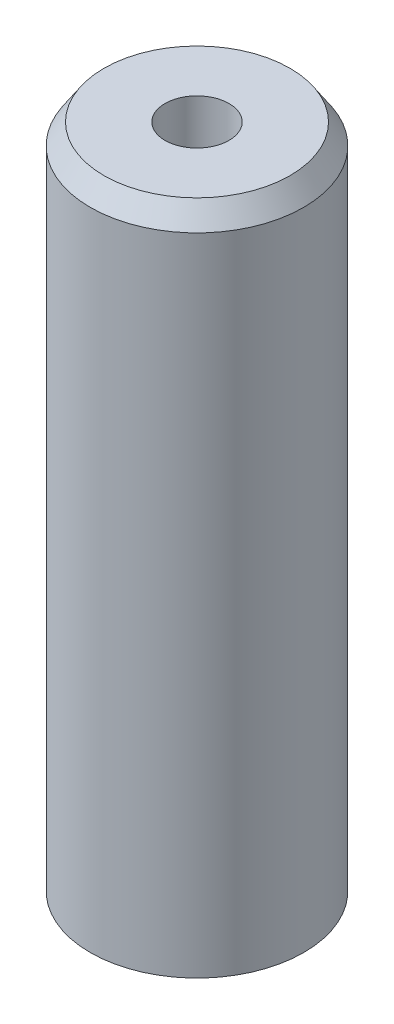
ISO-10303-21;
HEADER;
FILE_DESCRIPTION(('STEP AP214'),'2;1');
FILE_NAME('part.step','',(''),(''),'','','');
FILE_SCHEMA(('AUTOMOTIVE_DESIGN { 1 0 10303 214 1 1 1 1 }'));
ENDSEC;
DATA;
#1=APPLICATION_CONTEXT('core data for automotive mechanical design processes');
#2=APPLICATION_PROTOCOL_DEFINITION('international standard','automotive_design',2000,#1);
#3=PRODUCT_CONTEXT('',#1,'mechanical');
#4=PRODUCT('Part','Part','',(#3));
#5=PRODUCT_RELATED_PRODUCT_CATEGORY('part','',(#4));
#6=PRODUCT_DEFINITION_FORMATION('','',#4);
#7=PRODUCT_DEFINITION_CONTEXT('part definition',#1,'design');
#8=PRODUCT_DEFINITION('design','',#6,#7);
#9=PRODUCT_DEFINITION_SHAPE('','',#8);
#10=(LENGTH_UNIT() NAMED_UNIT(*) SI_UNIT(.MILLI.,.METRE.));
#11=(NAMED_UNIT(*) PLANE_ANGLE_UNIT() SI_UNIT($,.RADIAN.));
#12=(NAMED_UNIT(*) SI_UNIT($,.STERADIAN.) SOLID_ANGLE_UNIT());
#13=UNCERTAINTY_MEASURE_WITH_UNIT(LENGTH_MEASURE(1.E-05),#10,'distance_accuracy_value','');
#14=(GEOMETRIC_REPRESENTATION_CONTEXT(3) GLOBAL_UNCERTAINTY_ASSIGNED_CONTEXT((#13)) GLOBAL_UNIT_ASSIGNED_CONTEXT((#10,
#11,#12)) REPRESENTATION_CONTEXT('',''));
#15=CARTESIAN_POINT('',(0.,0.,0.));
#16=DIRECTION('',(0.,0.,1.));
#17=DIRECTION('',(1.,0.,0.));
#18=AXIS2_PLACEMENT_3D('',#15,#16,#17);
#19=CARTESIAN_POINT('',(0.,175.181369591506,0.));
#20=DIRECTION('',(0.,-1.,0.));
#21=DIRECTION('',(0.,0.,-1.));
#22=AXIS2_PLACEMENT_3D('',#19,#20,#21);
#23=CYLINDRICAL_SURFACE('',#22,27.5);
#24=CARTESIAN_POINT('',(0.,169.856475252578,0.));
#25=DIRECTION('',(0.,1.,0.));
#26=DIRECTION('',(0.,0.,1.));
#27=AXIS2_PLACEMENT_3D('',#24,#25,#26);
#28=CIRCLE('',#27,27.5);
#29=CARTESIAN_POINT('',(0.,169.856475252578,27.5));
#30=VERTEX_POINT('',#29);
#31=EDGE_CURVE('E50',#30,#30,#28,.F.);
#32=ORIENTED_EDGE('',*,*,#31,.T.);
#33=EDGE_LOOP('',(#32));
#34=FACE_BOUND('',#33,.T.);
#35=CARTESIAN_POINT('',(0.,3.52737737135717,0.));
#36=DIRECTION('',(0.,1.,0.));
#37=DIRECTION('',(0.,0.,1.));
#38=AXIS2_PLACEMENT_3D('',#35,#36,#37);
#39=CIRCLE('',#38,27.5);
#40=CARTESIAN_POINT('',(0.,3.52737737135717,27.5));
#41=VERTEX_POINT('',#40);
#42=EDGE_CURVE('E51',#41,#41,#39,.T.);
#43=ORIENTED_EDGE('',*,*,#42,.T.);
#44=EDGE_LOOP('',(#43));
#45=FACE_BOUND('',#44,.T.);
#46=ADVANCED_FACE('F39',(#34,#45),#23,.T.);
#47=CARTESIAN_POINT('',(0.,175.181369591506,0.));
#48=DIRECTION('',(0.,1.,0.));
#49=DIRECTION('',(0.,0.,1.));
#50=AXIS2_PLACEMENT_3D('',#47,#48,#49);
#51=PLANE('',#50);
#52=CARTESIAN_POINT('',(0.,175.181369591506,0.));
#53=DIRECTION('',(0.,1.,0.));
#54=DIRECTION('',(0.,0.,1.));
#55=AXIS2_PLACEMENT_3D('',#52,#53,#54);
#56=CIRCLE('',#55,23.9726226286429);
#57=CARTESIAN_POINT('',(0.,175.181369591506,23.9726226286429));
#58=VERTEX_POINT('',#57);
#59=EDGE_CURVE('E54',#58,#58,#56,.T.);
#60=ORIENTED_EDGE('',*,*,#59,.T.);
#61=EDGE_LOOP('',(#60));
#62=FACE_BOUND('',#61,.T.);
#63=CARTESIAN_POINT('',(0.,175.181369591506,0.));
#64=DIRECTION('',(0.,1.,0.));
#65=DIRECTION('',(0.,0.,1.));
#66=AXIS2_PLACEMENT_3D('',#63,#64,#65);
#67=CIRCLE('',#66,8.24808733378436);
#68=CARTESIAN_POINT('',(0.,175.181369591506,8.24808733378436));
#69=VERTEX_POINT('',#68);
#70=EDGE_CURVE('E58',#69,#69,#67,.T.);
#71=ORIENTED_EDGE('',*,*,#70,.F.);
#72=EDGE_LOOP('',(#71));
#73=FACE_BOUND('',#72,.T.);
#74=ADVANCED_FACE('F69',(#62,#73),#51,.T.);
#75=CARTESIAN_POINT('',(0.,0.,0.));
#76=DIRECTION('',(0.,1.,0.));
#77=DIRECTION('',(0.,0.,1.));
#78=AXIS2_PLACEMENT_3D('',#75,#76,#77);
#79=PLANE('',#78);
#80=CARTESIAN_POINT('',(0.,0.,0.));
#81=DIRECTION('',(0.,1.,0.));
#82=DIRECTION('',(0.,0.,1.));
#83=AXIS2_PLACEMENT_3D('',#80,#81,#82);
#84=CIRCLE('',#83,22.1751056610719);
#85=CARTESIAN_POINT('',(0.,0.,22.1751056610719));
#86=VERTEX_POINT('',#85);
#87=EDGE_CURVE('E10',#86,#86,#84,.F.);
#88=ORIENTED_EDGE('',*,*,#87,.T.);
#89=EDGE_LOOP('',(#88));
#90=FACE_BOUND('',#89,.T.);
#91=CARTESIAN_POINT('',(0.,0.,0.));
#92=DIRECTION('',(0.,1.,0.));
#93=DIRECTION('',(0.,0.,1.));
#94=AXIS2_PLACEMENT_3D('',#91,#92,#93);
#95=CIRCLE('',#94,8.24808733378436);
#96=CARTESIAN_POINT('',(0.,0.,8.24808733378436));
#97=VERTEX_POINT('',#96);
#98=EDGE_CURVE('E63',#97,#97,#95,.T.);
#99=ORIENTED_EDGE('',*,*,#98,.T.);
#100=EDGE_LOOP('',(#99));
#101=FACE_BOUND('',#100,.T.);
#102=ADVANCED_FACE('F75',(#90,#101),#79,.F.);
#103=CARTESIAN_POINT('',(0.,175.181369591506,0.));
#104=DIRECTION('',(0.,-1.,0.));
#105=DIRECTION('',(0.,0.,-1.));
#106=AXIS2_PLACEMENT_3D('',#103,#104,#105);
#107=CYLINDRICAL_SURFACE('',#106,8.24808733378436);
#108=ORIENTED_EDGE('',*,*,#70,.T.);
#109=EDGE_LOOP('',(#108));
#110=FACE_BOUND('',#109,.T.);
#111=ORIENTED_EDGE('',*,*,#98,.F.);
#112=EDGE_LOOP('',(#111));
#113=FACE_BOUND('',#112,.T.);
#114=ADVANCED_FACE('F70',(#110,#113),#107,.F.);
#115=CARTESIAN_POINT('',(0.,175.181369591506,0.));
#116=DIRECTION('',(0.,-1.,0.));
#117=DIRECTION('',(0.,0.,-1.));
#118=AXIS2_PLACEMENT_3D('',#115,#116,#117);
#119=CONICAL_SURFACE('',#118,23.9726226286429,0.585064782405427);
#120=ORIENTED_EDGE('',*,*,#31,.F.);
#121=EDGE_LOOP('',(#120));
#122=FACE_BOUND('',#121,.T.);
#123=ORIENTED_EDGE('',*,*,#59,.F.);
#124=EDGE_LOOP('',(#123));
#125=FACE_BOUND('',#124,.T.);
#126=ADVANCED_FACE('F81',(#122,#125),#119,.T.);
#127=CARTESIAN_POINT('',(0.,3.52737737135717,0.));
#128=DIRECTION('',(0.,1.,0.));
#129=DIRECTION('',(0.,0.,1.));
#130=AXIS2_PLACEMENT_3D('',#127,#128,#129);
#131=CONICAL_SURFACE('',#130,27.5,0.985731544389465);
#132=ORIENTED_EDGE('',*,*,#87,.F.);
#133=EDGE_LOOP('',(#132));
#134=FACE_BOUND('',#133,.T.);
#135=ORIENTED_EDGE('',*,*,#42,.F.);
#136=EDGE_LOOP('',(#135));
#137=FACE_BOUND('',#136,.T.);
#138=ADVANCED_FACE('F45',(#134,#137),#131,.T.);
#139=CLOSED_SHELL('',(#46,#74,#102,#114,#126,#138));
#140=MANIFOLD_SOLID_BREP('B2',#139);
#141=ADVANCED_BREP_SHAPE_REPRESENTATION('',(#18,#140),#14);
#142=SHAPE_DEFINITION_REPRESENTATION(#9,#141);
ENDSEC;
END-ISO-10303-21;
